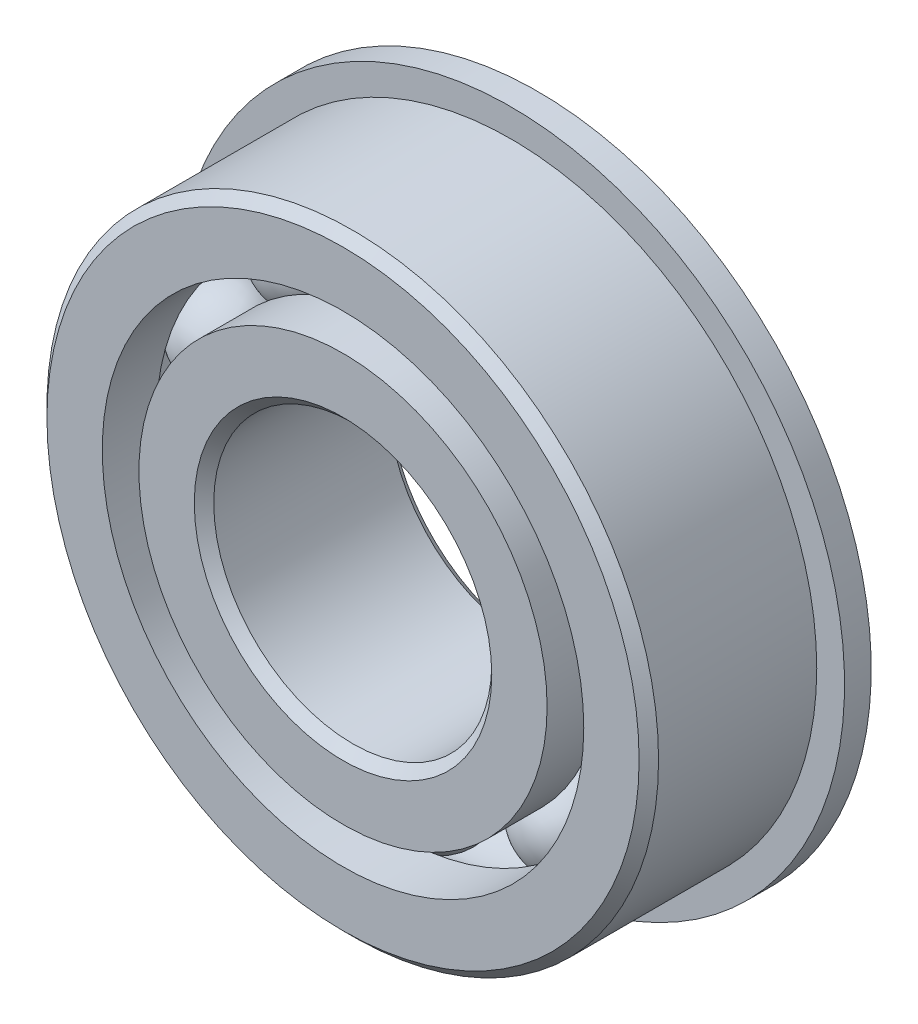
ISO-10303-21;
HEADER;
FILE_DESCRIPTION(('STEP AP214'),'2;1');
FILE_NAME('part.step','',(''),(''),'','','');
FILE_SCHEMA(('AUTOMOTIVE_DESIGN { 1 0 10303 214 1 1 1 1 }'));
ENDSEC;
DATA;
#1=APPLICATION_CONTEXT('core data for automotive mechanical design processes');
#2=APPLICATION_PROTOCOL_DEFINITION('international standard','automotive_design',2000,#1);
#3=PRODUCT_CONTEXT('',#1,'mechanical');
#4=PRODUCT('Part','Part','',(#3));
#5=PRODUCT_RELATED_PRODUCT_CATEGORY('part','',(#4));
#6=PRODUCT_DEFINITION_FORMATION('','',#4);
#7=PRODUCT_DEFINITION_CONTEXT('part definition',#1,'design');
#8=PRODUCT_DEFINITION('design','',#6,#7);
#9=PRODUCT_DEFINITION_SHAPE('','',#8);
#10=(LENGTH_UNIT() NAMED_UNIT(*) SI_UNIT(.MILLI.,.METRE.));
#11=(NAMED_UNIT(*) PLANE_ANGLE_UNIT() SI_UNIT($,.RADIAN.));
#12=(NAMED_UNIT(*) SI_UNIT($,.STERADIAN.) SOLID_ANGLE_UNIT());
#13=UNCERTAINTY_MEASURE_WITH_UNIT(LENGTH_MEASURE(1.E-05),#10,'distance_accuracy_value','');
#14=(GEOMETRIC_REPRESENTATION_CONTEXT(3) GLOBAL_UNCERTAINTY_ASSIGNED_CONTEXT((#13)) GLOBAL_UNIT_ASSIGNED_CONTEXT((#10,
#11,#12)) REPRESENTATION_CONTEXT('',''));
#15=CARTESIAN_POINT('',(0.,0.,0.));
#16=DIRECTION('',(0.,0.,1.));
#17=DIRECTION('',(1.,0.,0.));
#18=AXIS2_PLACEMENT_3D('',#15,#16,#17);
#19=CARTESIAN_POINT('',(-7.46487270411427,10.2745158285619,0.));
#20=DIRECTION('',(0.,0.,1.));
#21=DIRECTION('',(-0.587785252292462,0.809016994374955,0.));
#22=AXIS2_PLACEMENT_3D('',#19,#20,#21);
#23=SPHERICAL_SURFACE('',#22,2.68211551867683);
#24=CARTESIAN_POINT('',(-7.46487270411427,10.2745158285619,2.68211551867683));
#25=VERTEX_POINT('',#24);
#26=VERTEX_LOOP('',#25);
#27=FACE_BOUND('',#26,.T.);
#28=ADVANCED_FACE('F37',(#27),#23,.T.);
#29=CLOSED_SHELL('',(#28));
#30=MANIFOLD_SOLID_BREP('B2',#29);
#31=CARTESIAN_POINT('',(-12.0784177569484,3.92451582856197,0.));
#32=DIRECTION('',(0.,0.,1.));
#33=DIRECTION('',(-0.95105651629515,0.309016994374958,0.));
#34=AXIS2_PLACEMENT_3D('',#31,#32,#33);
#35=SPHERICAL_SURFACE('',#34,2.68211551867683);
#36=CARTESIAN_POINT('',(-12.0784177569484,3.92451582856197,2.68211551867683));
#37=VERTEX_POINT('',#36);
#38=VERTEX_LOOP('',#37);
#39=FACE_BOUND('',#38,.T.);
#40=ADVANCED_FACE('F57',(#39),#35,.T.);
#41=CLOSED_SHELL('',(#40));
#42=MANIFOLD_SOLID_BREP('B6',#41);
#43=CARTESIAN_POINT('',(-12.0784177569485,-3.92451582856172,0.));
#44=DIRECTION('',(0.,0.,1.));
#45=DIRECTION('',(-0.951056516295157,-0.309016994374938,0.));
#46=AXIS2_PLACEMENT_3D('',#43,#44,#45);
#47=SPHERICAL_SURFACE('',#46,2.68211551867683);
#48=CARTESIAN_POINT('',(-12.0784177569485,-3.92451582856172,2.68211551867683));
#49=VERTEX_POINT('',#48);
#50=VERTEX_LOOP('',#49);
#51=FACE_BOUND('',#50,.T.);
#52=ADVANCED_FACE('F77',(#51),#47,.T.);
#53=CLOSED_SHELL('',(#52));
#54=MANIFOLD_SOLID_BREP('B33',#53);
#55=CARTESIAN_POINT('',(-7.4648727041145,-10.2745158285618,0.));
#56=DIRECTION('',(0.,0.,1.));
#57=DIRECTION('',(-0.58778525229248,-0.809016994374942,0.));
#58=AXIS2_PLACEMENT_3D('',#55,#56,#57);
#59=SPHERICAL_SURFACE('',#58,2.68211551867683);
#60=CARTESIAN_POINT('',(-7.4648727041145,-10.2745158285618,2.68211551867683));
#61=VERTEX_POINT('',#60);
#62=VERTEX_LOOP('',#61);
#63=FACE_BOUND('',#62,.T.);
#64=ADVANCED_FACE('F97',(#63),#59,.T.);
#65=CLOSED_SHELL('',(#64));
#66=MANIFOLD_SOLID_BREP('B53',#65);
#67=CARTESIAN_POINT('',(0.,-12.7,0.));
#68=DIRECTION('',(0.,0.,1.));
#69=DIRECTION('',(0.,-1.,0.));
#70=AXIS2_PLACEMENT_3D('',#67,#68,#69);
#71=SPHERICAL_SURFACE('',#70,2.68211551867683);
#72=CARTESIAN_POINT('',(0.,-12.7,2.68211551867683));
#73=VERTEX_POINT('',#72);
#74=VERTEX_LOOP('',#73);
#75=FACE_BOUND('',#74,.T.);
#76=ADVANCED_FACE('F117',(#75),#71,.T.);
#77=CLOSED_SHELL('',(#76));
#78=MANIFOLD_SOLID_BREP('B73',#77);
#79=CARTESIAN_POINT('',(7.46487270411435,-10.2745158285619,0.));
#80=DIRECTION('',(0.,0.,1.));
#81=DIRECTION('',(0.587785252292469,-0.809016994374951,0.));
#82=AXIS2_PLACEMENT_3D('',#79,#80,#81);
#83=SPHERICAL_SURFACE('',#82,2.68211551867683);
#84=CARTESIAN_POINT('',(7.46487270411435,-10.2745158285619,2.68211551867683));
#85=VERTEX_POINT('',#84);
#86=VERTEX_LOOP('',#85);
#87=FACE_BOUND('',#86,.T.);
#88=ADVANCED_FACE('F137',(#87),#83,.T.);
#89=CLOSED_SHELL('',(#88));
#90=MANIFOLD_SOLID_BREP('B93',#89);
#91=CARTESIAN_POINT('',(12.0784177569484,-3.92451582856189,0.));
#92=DIRECTION('',(0.,0.,1.));
#93=DIRECTION('',(0.951056516295152,-0.309016994374952,0.));
#94=AXIS2_PLACEMENT_3D('',#91,#92,#93);
#95=SPHERICAL_SURFACE('',#94,2.68211551867683);
#96=CARTESIAN_POINT('',(12.0784177569484,-3.92451582856189,2.68211551867683));
#97=VERTEX_POINT('',#96);
#98=VERTEX_LOOP('',#97);
#99=FACE_BOUND('',#98,.T.);
#100=ADVANCED_FACE('F157',(#99),#95,.T.);
#101=CLOSED_SHELL('',(#100));
#102=MANIFOLD_SOLID_BREP('B113',#101);
#103=CARTESIAN_POINT('',(12.0784177569485,3.9245158285618,0.));
#104=DIRECTION('',(0.,0.,1.));
#105=DIRECTION('',(0.951056516295155,0.309016994374945,0.));
#106=AXIS2_PLACEMENT_3D('',#103,#104,#105);
#107=SPHERICAL_SURFACE('',#106,2.68211551867683);
#108=CARTESIAN_POINT('',(12.0784177569485,3.9245158285618,2.68211551867683));
#109=VERTEX_POINT('',#108);
#110=VERTEX_LOOP('',#109);
#111=FACE_BOUND('',#110,.T.);
#112=ADVANCED_FACE('F177',(#111),#107,.T.);
#113=CLOSED_SHELL('',(#112));
#114=MANIFOLD_SOLID_BREP('B133',#113);
#115=CARTESIAN_POINT('',(7.46487270411442,10.2745158285618,0.));
#116=DIRECTION('',(0.,0.,1.));
#117=DIRECTION('',(0.587785252292474,0.809016994374947,0.));
#118=AXIS2_PLACEMENT_3D('',#115,#116,#117);
#119=SPHERICAL_SURFACE('',#118,2.68211551867683);
#120=CARTESIAN_POINT('',(7.46487270411442,10.2745158285618,2.68211551867683));
#121=VERTEX_POINT('',#120);
#122=VERTEX_LOOP('',#121);
#123=FACE_BOUND('',#122,.T.);
#124=ADVANCED_FACE('F197',(#123),#119,.T.);
#125=CLOSED_SHELL('',(#124));
#126=MANIFOLD_SOLID_BREP('B153',#125);
#127=CARTESIAN_POINT('',(0.,12.7,0.));
#128=DIRECTION('',(0.,0.,1.));
#129=DIRECTION('',(0.,1.,0.));
#130=AXIS2_PLACEMENT_3D('',#127,#128,#129);
#131=SPHERICAL_SURFACE('',#130,2.68211551867683);
#132=CARTESIAN_POINT('',(0.,12.7,2.68211551867683));
#133=VERTEX_POINT('',#132);
#134=VERTEX_LOOP('',#133);
#135=FACE_BOUND('',#134,.T.);
#136=ADVANCED_FACE('F219',(#135),#131,.T.);
#137=CLOSED_SHELL('',(#136));
#138=MANIFOLD_SOLID_BREP('B173',#137);
#139=CARTESIAN_POINT('',(0.,11.6532967032967,5.55625));
#140=DIRECTION('',(0.,0.,-1.));
#141=DIRECTION('',(-1.,0.,0.));
#142=AXIS2_PLACEMENT_3D('',#139,#140,#141);
#143=PLANE('',#142);
#144=CARTESIAN_POINT('',(0.,0.,5.55625));
#145=DIRECTION('',(0.,0.,1.));
#146=DIRECTION('',(1.,0.,0.));
#147=AXIS2_PLACEMENT_3D('',#144,#145,#146);
#148=CIRCLE('',#147,8.493125);
#149=CARTESIAN_POINT('',(8.493125,0.,5.55625));
#150=VERTEX_POINT('',#149);
#151=EDGE_CURVE('E266',#150,#150,#148,.T.);
#152=ORIENTED_EDGE('',*,*,#151,.F.);
#153=EDGE_LOOP('',(#152));
#154=FACE_BOUND('',#153,.T.);
#155=CARTESIAN_POINT('',(0.,0.,5.55625));
#156=DIRECTION('',(0.,0.,1.));
#157=DIRECTION('',(1.,0.,0.));
#158=AXIS2_PLACEMENT_3D('',#155,#156,#157);
#159=CIRCLE('',#158,11.6532967032967);
#160=CARTESIAN_POINT('',(11.6532967032967,0.,5.55625));
#161=VERTEX_POINT('',#160);
#162=EDGE_CURVE('E218',#161,#161,#159,.T.);
#163=ORIENTED_EDGE('',*,*,#162,.T.);
#164=EDGE_LOOP('',(#163));
#165=FACE_BOUND('',#164,.T.);
#166=ADVANCED_FACE('F238',(#154,#165),#143,.F.);
#167=CARTESIAN_POINT('',(0.,0.,5.55625));
#168=DIRECTION('',(0.,0.,1.));
#169=DIRECTION('',(1.,0.,0.));
#170=AXIS2_PLACEMENT_3D('',#167,#168,#169);
#171=CYLINDRICAL_SURFACE('',#170,11.6532967032967);
#172=ORIENTED_EDGE('',*,*,#162,.F.);
#173=EDGE_LOOP('',(#172));
#174=FACE_BOUND('',#173,.T.);
#175=CARTESIAN_POINT('',(0.,0.,2.46944444444444));
#176=DIRECTION('',(0.,0.,1.));
#177=DIRECTION('',(1.,0.,0.));
#178=AXIS2_PLACEMENT_3D('',#175,#176,#177);
#179=CIRCLE('',#178,11.6532967032967);
#180=CARTESIAN_POINT('',(11.6532967032967,0.,2.46944444444444));
#181=VERTEX_POINT('',#180);
#182=EDGE_CURVE('E244',#181,#181,#179,.T.);
#183=ORIENTED_EDGE('',*,*,#182,.T.);
#184=EDGE_LOOP('',(#183));
#185=FACE_BOUND('',#184,.T.);
#186=ADVANCED_FACE('F273',(#174,#185),#171,.T.);
#187=CARTESIAN_POINT('',(0.,0.,0.));
#188=DIRECTION('',(0.,0.,1.));
#189=DIRECTION('',(1.,0.,0.));
#190=AXIS2_PLACEMENT_3D('',#187,#188,#189);
#191=TOROIDAL_SURFACE('',#190,12.7,2.68211551867683);
#192=ORIENTED_EDGE('',*,*,#182,.F.);
#193=EDGE_LOOP('',(#192));
#194=FACE_BOUND('',#193,.T.);
#195=CARTESIAN_POINT('',(0.,0.,-2.46944444444445));
#196=DIRECTION('',(0.,0.,1.));
#197=DIRECTION('',(1.,0.,0.));
#198=AXIS2_PLACEMENT_3D('',#195,#196,#197);
#199=CIRCLE('',#198,11.6532967032967);
#200=CARTESIAN_POINT('',(11.6532967032967,0.,-2.46944444444445));
#201=VERTEX_POINT('',#200);
#202=EDGE_CURVE('E248',#201,#201,#199,.T.);
#203=ORIENTED_EDGE('',*,*,#202,.T.);
#204=EDGE_LOOP('',(#203));
#205=FACE_BOUND('',#204,.T.);
#206=ADVANCED_FACE('F277',(#194,#205),#191,.F.);
#207=CARTESIAN_POINT('',(0.,0.,5.55625));
#208=DIRECTION('',(0.,0.,1.));
#209=DIRECTION('',(1.,0.,0.));
#210=AXIS2_PLACEMENT_3D('',#207,#208,#209);
#211=CYLINDRICAL_SURFACE('',#210,11.6532967032967);
#212=ORIENTED_EDGE('',*,*,#202,.F.);
#213=EDGE_LOOP('',(#212));
#214=FACE_BOUND('',#213,.T.);
#215=CARTESIAN_POINT('',(0.,0.,-5.55625));
#216=DIRECTION('',(0.,0.,1.));
#217=DIRECTION('',(1.,0.,0.));
#218=AXIS2_PLACEMENT_3D('',#215,#216,#217);
#219=CIRCLE('',#218,11.6532967032967);
#220=CARTESIAN_POINT('',(11.6532967032967,0.,-5.55625));
#221=VERTEX_POINT('',#220);
#222=EDGE_CURVE('E252',#221,#221,#219,.T.);
#223=ORIENTED_EDGE('',*,*,#222,.T.);
#224=EDGE_LOOP('',(#223));
#225=FACE_BOUND('',#224,.T.);
#226=ADVANCED_FACE('F282',(#214,#225),#211,.T.);
#227=CARTESIAN_POINT('',(0.,8.493125,-5.55625));
#228=DIRECTION('',(0.,0.,1.));
#229=DIRECTION('',(1.,0.,0.));
#230=AXIS2_PLACEMENT_3D('',#227,#228,#229);
#231=PLANE('',#230);
#232=ORIENTED_EDGE('',*,*,#222,.F.);
#233=EDGE_LOOP('',(#232));
#234=FACE_BOUND('',#233,.T.);
#235=CARTESIAN_POINT('',(0.,0.,-5.55625));
#236=DIRECTION('',(0.,0.,1.));
#237=DIRECTION('',(1.,0.,0.));
#238=AXIS2_PLACEMENT_3D('',#235,#236,#237);
#239=CIRCLE('',#238,8.493125);
#240=CARTESIAN_POINT('',(8.493125,0.,-5.55625));
#241=VERTEX_POINT('',#240);
#242=EDGE_CURVE('E257',#241,#241,#239,.T.);
#243=ORIENTED_EDGE('',*,*,#242,.T.);
#244=EDGE_LOOP('',(#243));
#245=FACE_BOUND('',#244,.T.);
#246=ADVANCED_FACE('F288',(#234,#245),#231,.F.);
#247=CARTESIAN_POINT('',(0.,0.,-5.000625));
#248=DIRECTION('',(0.,0.,-1.));
#249=DIRECTION('',(-1.,0.,0.));
#250=AXIS2_PLACEMENT_3D('',#247,#248,#249);
#251=CONICAL_SURFACE('',#250,7.9375,0.785398163397442);
#252=ORIENTED_EDGE('',*,*,#242,.F.);
#253=EDGE_LOOP('',(#252));
#254=FACE_BOUND('',#253,.T.);
#255=CARTESIAN_POINT('',(0.,0.,-5.000625));
#256=DIRECTION('',(0.,0.,1.));
#257=DIRECTION('',(1.,0.,0.));
#258=AXIS2_PLACEMENT_3D('',#255,#256,#257);
#259=CIRCLE('',#258,7.9375);
#260=CARTESIAN_POINT('',(7.9375,0.,-5.000625));
#261=VERTEX_POINT('',#260);
#262=EDGE_CURVE('E260',#261,#261,#259,.T.);
#263=ORIENTED_EDGE('',*,*,#262,.T.);
#264=EDGE_LOOP('',(#263));
#265=FACE_BOUND('',#264,.T.);
#266=ADVANCED_FACE('F292',(#254,#265),#251,.F.);
#267=CARTESIAN_POINT('',(0.,0.,5.55625));
#268=DIRECTION('',(0.,0.,1.));
#269=DIRECTION('',(1.,0.,0.));
#270=AXIS2_PLACEMENT_3D('',#267,#268,#269);
#271=CYLINDRICAL_SURFACE('',#270,7.9375);
#272=ORIENTED_EDGE('',*,*,#262,.F.);
#273=EDGE_LOOP('',(#272));
#274=FACE_BOUND('',#273,.T.);
#275=CARTESIAN_POINT('',(0.,0.,5.000625));
#276=DIRECTION('',(0.,0.,1.));
#277=DIRECTION('',(1.,0.,0.));
#278=AXIS2_PLACEMENT_3D('',#275,#276,#277);
#279=CIRCLE('',#278,7.9375);
#280=CARTESIAN_POINT('',(7.9375,0.,5.000625));
#281=VERTEX_POINT('',#280);
#282=EDGE_CURVE('E263',#281,#281,#279,.T.);
#283=ORIENTED_EDGE('',*,*,#282,.T.);
#284=EDGE_LOOP('',(#283));
#285=FACE_BOUND('',#284,.T.);
#286=ADVANCED_FACE('F296',(#274,#285),#271,.F.);
#287=CARTESIAN_POINT('',(0.,0.,5.55625));
#288=DIRECTION('',(0.,0.,1.));
#289=DIRECTION('',(1.,0.,0.));
#290=AXIS2_PLACEMENT_3D('',#287,#288,#289);
#291=CONICAL_SURFACE('',#290,8.493125,0.785398163397455);
#292=ORIENTED_EDGE('',*,*,#282,.F.);
#293=EDGE_LOOP('',(#292));
#294=FACE_BOUND('',#293,.T.);
#295=ORIENTED_EDGE('',*,*,#151,.T.);
#296=EDGE_LOOP('',(#295));
#297=FACE_BOUND('',#296,.T.);
#298=ADVANCED_FACE('F270',(#294,#297),#291,.F.);
#299=CLOSED_SHELL('',(#166,#186,#206,#226,#246,#266,#286,#298));
#300=MANIFOLD_SOLID_BREP('B193',#299);
#301=CARTESIAN_POINT('',(0.,0.,5.000625));
#302=DIRECTION('',(0.,0.,-1.));
#303=DIRECTION('',(-1.,0.,0.));
#304=AXIS2_PLACEMENT_3D('',#301,#302,#303);
#305=CONICAL_SURFACE('',#304,17.4625,0.785398163397446);
#306=CARTESIAN_POINT('',(0.,0.,5.55625));
#307=DIRECTION('',(0.,0.,1.));
#308=DIRECTION('',(1.,0.,0.));
#309=AXIS2_PLACEMENT_3D('',#306,#307,#308);
#310=CIRCLE('',#309,16.906875);
#311=CARTESIAN_POINT('',(16.906875,0.,5.55625));
#312=VERTEX_POINT('',#311);
#313=EDGE_CURVE('E381',#312,#312,#310,.T.);
#314=ORIENTED_EDGE('',*,*,#313,.F.);
#315=EDGE_LOOP('',(#314));
#316=FACE_BOUND('',#315,.T.);
#317=CARTESIAN_POINT('',(0.,0.,5.000625));
#318=DIRECTION('',(0.,0.,1.));
#319=DIRECTION('',(1.,0.,0.));
#320=AXIS2_PLACEMENT_3D('',#317,#318,#319);
#321=CIRCLE('',#320,17.4625);
#322=CARTESIAN_POINT('',(17.4625,0.,5.000625));
#323=VERTEX_POINT('',#322);
#324=EDGE_CURVE('E237',#323,#323,#321,.T.);
#325=ORIENTED_EDGE('',*,*,#324,.T.);
#326=EDGE_LOOP('',(#325));
#327=FACE_BOUND('',#326,.T.);
#328=ADVANCED_FACE('F359',(#316,#327),#305,.T.);
#329=CARTESIAN_POINT('',(0.,0.,5.55625));
#330=DIRECTION('',(0.,0.,1.));
#331=DIRECTION('',(1.,0.,0.));
#332=AXIS2_PLACEMENT_3D('',#329,#330,#331);
#333=CYLINDRICAL_SURFACE('',#332,17.4625);
#334=CARTESIAN_POINT('',(0.,0.,-4.03225));
#335=DIRECTION('',(0.,0.,1.));
#336=DIRECTION('',(1.,0.,0.));
#337=AXIS2_PLACEMENT_3D('',#334,#335,#336);
#338=CIRCLE('',#337,17.4625);
#339=CARTESIAN_POINT('',(17.4625,0.,-4.03225));
#340=VERTEX_POINT('',#339);
#341=EDGE_CURVE('E384',#340,#340,#338,.T.);
#342=ORIENTED_EDGE('',*,*,#341,.T.);
#343=EDGE_LOOP('',(#342));
#344=FACE_BOUND('',#343,.T.);
#345=ORIENTED_EDGE('',*,*,#324,.F.);
#346=EDGE_LOOP('',(#345));
#347=FACE_BOUND('',#346,.T.);
#348=ADVANCED_FACE('F404',(#344,#347),#333,.T.);
#349=CARTESIAN_POINT('',(0.,16.906875,-5.55625));
#350=DIRECTION('',(0.,0.,1.));
#351=DIRECTION('',(1.,0.,0.));
#352=AXIS2_PLACEMENT_3D('',#349,#350,#351);
#353=PLANE('',#352);
#354=CARTESIAN_POINT('',(0.,0.,-5.55625));
#355=DIRECTION('',(0.,0.,1.));
#356=DIRECTION('',(1.,0.,0.));
#357=AXIS2_PLACEMENT_3D('',#354,#355,#356);
#358=CIRCLE('',#357,13.7467032967033);
#359=CARTESIAN_POINT('',(13.7467032967033,0.,-5.55625));
#360=VERTEX_POINT('',#359);
#361=EDGE_CURVE('E365',#360,#360,#358,.T.);
#362=ORIENTED_EDGE('',*,*,#361,.T.);
#363=EDGE_LOOP('',(#362));
#364=FACE_BOUND('',#363,.T.);
#365=CARTESIAN_POINT('',(0.,0.,-5.55625));
#366=DIRECTION('',(0.,0.,-1.));
#367=DIRECTION('',(-1.,0.,0.));
#368=AXIS2_PLACEMENT_3D('',#365,#366,#367);
#369=CIRCLE('',#368,19.05);
#370=CARTESIAN_POINT('',(-19.05,0.,-5.55625));
#371=VERTEX_POINT('',#370);
#372=EDGE_CURVE('E387',#371,#371,#369,.T.);
#373=ORIENTED_EDGE('',*,*,#372,.T.);
#374=EDGE_LOOP('',(#373));
#375=FACE_BOUND('',#374,.T.);
#376=ADVANCED_FACE('F407',(#364,#375),#353,.F.);
#377=CARTESIAN_POINT('',(0.,0.,5.55625));
#378=DIRECTION('',(0.,0.,1.));
#379=DIRECTION('',(1.,0.,0.));
#380=AXIS2_PLACEMENT_3D('',#377,#378,#379);
#381=CYLINDRICAL_SURFACE('',#380,13.7467032967033);
#382=CARTESIAN_POINT('',(0.,0.,-2.46944444444444));
#383=DIRECTION('',(0.,0.,1.));
#384=DIRECTION('',(1.,0.,0.));
#385=AXIS2_PLACEMENT_3D('',#382,#383,#384);
#386=CIRCLE('',#385,13.7467032967033);
#387=CARTESIAN_POINT('',(13.7467032967033,0.,-2.46944444444444));
#388=VERTEX_POINT('',#387);
#389=EDGE_CURVE('E369',#388,#388,#386,.T.);
#390=ORIENTED_EDGE('',*,*,#389,.T.);
#391=EDGE_LOOP('',(#390));
#392=FACE_BOUND('',#391,.T.);
#393=ORIENTED_EDGE('',*,*,#361,.F.);
#394=EDGE_LOOP('',(#393));
#395=FACE_BOUND('',#394,.T.);
#396=ADVANCED_FACE('F412',(#392,#395),#381,.F.);
#397=CARTESIAN_POINT('',(0.,0.,0.));
#398=DIRECTION('',(0.,0.,1.));
#399=DIRECTION('',(1.,0.,0.));
#400=AXIS2_PLACEMENT_3D('',#397,#398,#399);
#401=TOROIDAL_SURFACE('',#400,12.7,2.68211551867683);
#402=ORIENTED_EDGE('',*,*,#389,.F.);
#403=EDGE_LOOP('',(#402));
#404=FACE_BOUND('',#403,.T.);
#405=CARTESIAN_POINT('',(0.,0.,2.46944444444444));
#406=DIRECTION('',(0.,0.,1.));
#407=DIRECTION('',(1.,0.,0.));
#408=AXIS2_PLACEMENT_3D('',#405,#406,#407);
#409=CIRCLE('',#408,13.7467032967033);
#410=CARTESIAN_POINT('',(13.7467032967033,0.,2.46944444444444));
#411=VERTEX_POINT('',#410);
#412=EDGE_CURVE('E373',#411,#411,#409,.T.);
#413=ORIENTED_EDGE('',*,*,#412,.T.);
#414=EDGE_LOOP('',(#413));
#415=FACE_BOUND('',#414,.T.);
#416=ADVANCED_FACE('F418',(#404,#415),#401,.F.);
#417=CARTESIAN_POINT('',(0.,0.,5.55625));
#418=DIRECTION('',(0.,0.,1.));
#419=DIRECTION('',(1.,0.,0.));
#420=AXIS2_PLACEMENT_3D('',#417,#418,#419);
#421=CYLINDRICAL_SURFACE('',#420,13.7467032967033);
#422=ORIENTED_EDGE('',*,*,#412,.F.);
#423=EDGE_LOOP('',(#422));
#424=FACE_BOUND('',#423,.T.);
#425=CARTESIAN_POINT('',(0.,0.,5.55625));
#426=DIRECTION('',(0.,0.,1.));
#427=DIRECTION('',(1.,0.,0.));
#428=AXIS2_PLACEMENT_3D('',#425,#426,#427);
#429=CIRCLE('',#428,13.7467032967033);
#430=CARTESIAN_POINT('',(13.7467032967033,0.,5.55625));
#431=VERTEX_POINT('',#430);
#432=EDGE_CURVE('E378',#431,#431,#429,.T.);
#433=ORIENTED_EDGE('',*,*,#432,.T.);
#434=EDGE_LOOP('',(#433));
#435=FACE_BOUND('',#434,.T.);
#436=ADVANCED_FACE('F422',(#424,#435),#421,.F.);
#437=CARTESIAN_POINT('',(0.,16.906875,5.55625));
#438=DIRECTION('',(0.,0.,-1.));
#439=DIRECTION('',(-1.,0.,0.));
#440=AXIS2_PLACEMENT_3D('',#437,#438,#439);
#441=PLANE('',#440);
#442=ORIENTED_EDGE('',*,*,#432,.F.);
#443=EDGE_LOOP('',(#442));
#444=FACE_BOUND('',#443,.T.);
#445=ORIENTED_EDGE('',*,*,#313,.T.);
#446=EDGE_LOOP('',(#445));
#447=FACE_BOUND('',#446,.T.);
#448=ADVANCED_FACE('F400',(#444,#447),#441,.F.);
#449=CARTESIAN_POINT('',(0.,13.7467032967033,-4.03225));
#450=DIRECTION('',(0.,0.,1.));
#451=DIRECTION('',(1.,0.,0.));
#452=AXIS2_PLACEMENT_3D('',#449,#450,#451);
#453=PLANE('',#452);
#454=CARTESIAN_POINT('',(0.,0.,-4.03225));
#455=DIRECTION('',(0.,0.,-1.));
#456=DIRECTION('',(-1.,0.,0.));
#457=AXIS2_PLACEMENT_3D('',#454,#455,#456);
#458=CIRCLE('',#457,19.05);
#459=CARTESIAN_POINT('',(-19.05,0.,-4.03225));
#460=VERTEX_POINT('',#459);
#461=EDGE_CURVE('E390',#460,#460,#458,.T.);
#462=ORIENTED_EDGE('',*,*,#461,.F.);
#463=EDGE_LOOP('',(#462));
#464=FACE_BOUND('',#463,.T.);
#465=ORIENTED_EDGE('',*,*,#341,.F.);
#466=EDGE_LOOP('',(#465));
#467=FACE_BOUND('',#466,.T.);
#468=ADVANCED_FACE('F397',(#464,#467),#453,.T.);
#469=CARTESIAN_POINT('',(0.,0.,-5.55625));
#470=DIRECTION('',(0.,0.,-1.));
#471=DIRECTION('',(-1.,0.,0.));
#472=AXIS2_PLACEMENT_3D('',#469,#470,#471);
#473=CYLINDRICAL_SURFACE('',#472,19.05);
#474=ORIENTED_EDGE('',*,*,#461,.T.);
#475=EDGE_LOOP('',(#474));
#476=FACE_BOUND('',#475,.T.);
#477=ORIENTED_EDGE('',*,*,#372,.F.);
#478=EDGE_LOOP('',(#477));
#479=FACE_BOUND('',#478,.T.);
#480=ADVANCED_FACE('F394',(#476,#479),#473,.T.);
#481=CLOSED_SHELL('',(#328,#348,#376,#396,#416,#436,#448,#468,#480));
#482=MANIFOLD_SOLID_BREP('B213',#481);
#483=ADVANCED_BREP_SHAPE_REPRESENTATION('',(#18,#30,#42,#54,#66,#78,#90,#102,#114,#126,#138,
#300,#482),#14);
#484=SHAPE_DEFINITION_REPRESENTATION(#9,#483);
ENDSEC;
END-ISO-10303-21;
